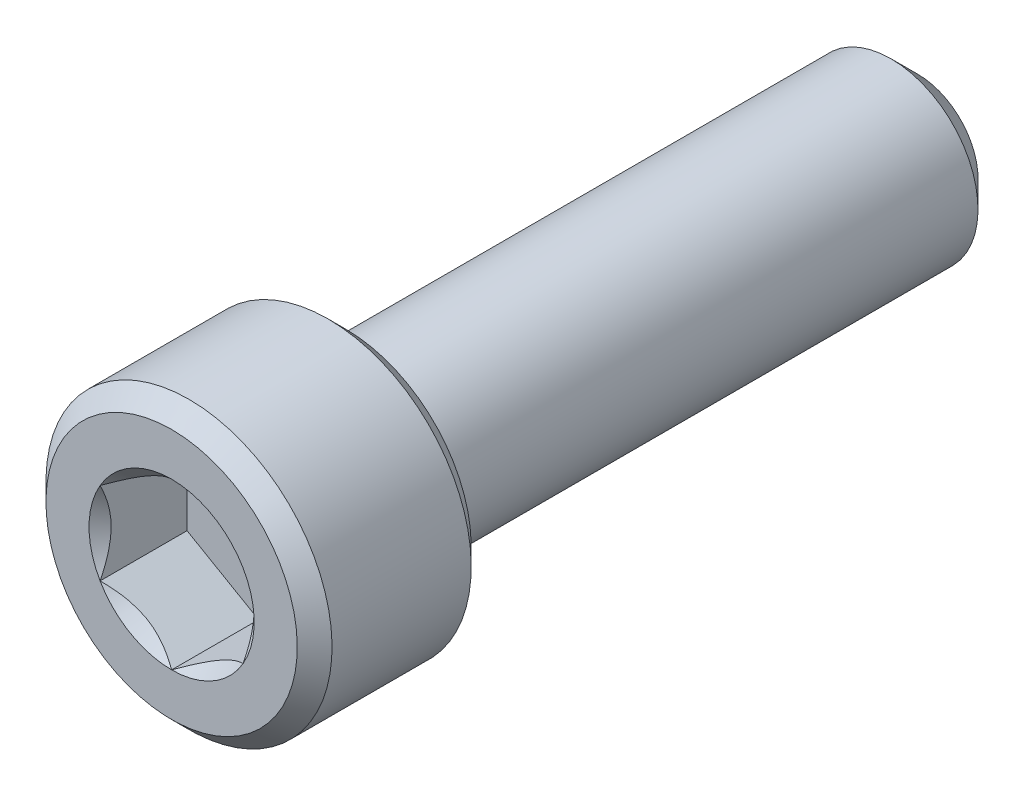
ISO-10303-21;
HEADER;
FILE_DESCRIPTION(('STEP AP214'),'2;1');
FILE_NAME('part.step','',(''),(''),'','','');
FILE_SCHEMA(('AUTOMOTIVE_DESIGN { 1 0 10303 214 1 1 1 1 }'));
ENDSEC;
DATA;
#1=APPLICATION_CONTEXT('core data for automotive mechanical design processes');
#2=APPLICATION_PROTOCOL_DEFINITION('international standard','automotive_design',2000,#1);
#3=PRODUCT_CONTEXT('',#1,'mechanical');
#4=PRODUCT('Part','Part','',(#3));
#5=PRODUCT_RELATED_PRODUCT_CATEGORY('part','',(#4));
#6=PRODUCT_DEFINITION_FORMATION('','',#4);
#7=PRODUCT_DEFINITION_CONTEXT('part definition',#1,'design');
#8=PRODUCT_DEFINITION('design','',#6,#7);
#9=PRODUCT_DEFINITION_SHAPE('','',#8);
#10=(LENGTH_UNIT() NAMED_UNIT(*) SI_UNIT(.MILLI.,.METRE.));
#11=(NAMED_UNIT(*) PLANE_ANGLE_UNIT() SI_UNIT($,.RADIAN.));
#12=(NAMED_UNIT(*) SI_UNIT($,.STERADIAN.) SOLID_ANGLE_UNIT());
#13=UNCERTAINTY_MEASURE_WITH_UNIT(LENGTH_MEASURE(1.E-05),#10,'distance_accuracy_value','');
#14=(GEOMETRIC_REPRESENTATION_CONTEXT(3) GLOBAL_UNCERTAINTY_ASSIGNED_CONTEXT((#13)) GLOBAL_UNIT_ASSIGNED_CONTEXT((#10,
#11,#12)) REPRESENTATION_CONTEXT('',''));
#15=CARTESIAN_POINT('',(0.,0.,0.));
#16=DIRECTION('',(0.,0.,1.));
#17=DIRECTION('',(1.,0.,0.));
#18=AXIS2_PLACEMENT_3D('',#15,#16,#17);
#19=CARTESIAN_POINT('',(0.,1.67216666666667,-10.3505));
#20=DIRECTION('',(0.,0.,-1.));
#21=DIRECTION('',(0.,1.,0.));
#22=AXIS2_PLACEMENT_3D('',#19,#20,#21);
#23=PLANE('',#22);
#24=CARTESIAN_POINT('',(0.,0.,-10.3505));
#25=DIRECTION('',(0.,0.,-1.));
#26=DIRECTION('',(0.,1.,0.));
#27=AXIS2_PLACEMENT_3D('',#24,#25,#26);
#28=CIRCLE('',#27,1.67216666666668);
#29=CARTESIAN_POINT('',(0.,1.67216666666667,-10.3505));
#30=VERTEX_POINT('',#29);
#31=EDGE_CURVE('E217',#30,#30,#28,.T.);
#32=ORIENTED_EDGE('',*,*,#31,.T.);
#33=EDGE_LOOP('',(#32));
#34=FACE_BOUND('',#33,.T.);
#35=ADVANCED_FACE('F38',(#34),#23,.T.);
#36=CARTESIAN_POINT('',(0.,0.,10.3505));
#37=DIRECTION('',(0.,0.,1.));
#38=DIRECTION('',(0.,-1.,0.));
#39=AXIS2_PLACEMENT_3D('',#36,#37,#38);
#40=PLANE('',#39);
#41=CARTESIAN_POINT('',(0.,0.,10.3505));
#42=DIRECTION('',(0.,0.,1.));
#43=DIRECTION('',(1.,0.,0.));
#44=AXIS2_PLACEMENT_3D('',#41,#42,#43);
#45=CIRCLE('',#44,2.29135888084633);
#46=CARTESIAN_POINT('',(0.,-2.29135888084633,10.3505));
#47=VERTEX_POINT('',#46);
#48=CARTESIAN_POINT('',(1.98437500000001,-1.14567944042315,10.3505));
#49=VERTEX_POINT('',#48);
#50=EDGE_CURVE('E109',#47,#49,#45,.T.);
#51=ORIENTED_EDGE('',*,*,#50,.F.);
#52=CARTESIAN_POINT('',(-1.984375,-1.14567944042316,10.3505));
#53=VERTEX_POINT('',#52);
#54=EDGE_CURVE('E98',#53,#47,#45,.T.);
#55=ORIENTED_EDGE('',*,*,#54,.F.);
#56=CARTESIAN_POINT('',(-1.984375,1.14567944042317,10.3505));
#57=VERTEX_POINT('',#56);
#58=EDGE_CURVE('E108',#57,#53,#45,.T.);
#59=ORIENTED_EDGE('',*,*,#58,.F.);
#60=CARTESIAN_POINT('',(0.,2.29135888084633,10.3505));
#61=VERTEX_POINT('',#60);
#62=EDGE_CURVE('E58',#61,#57,#45,.T.);
#63=ORIENTED_EDGE('',*,*,#62,.F.);
#64=CARTESIAN_POINT('',(1.984375,1.14567944042317,10.3505));
#65=VERTEX_POINT('',#64);
#66=EDGE_CURVE('E65',#65,#61,#45,.T.);
#67=ORIENTED_EDGE('',*,*,#66,.F.);
#68=EDGE_CURVE('E139',#49,#65,#45,.T.);
#69=ORIENTED_EDGE('',*,*,#68,.F.);
#70=EDGE_LOOP('',(#51,#55,#59,#63,#67,#69));
#71=FACE_BOUND('',#70,.T.);
#72=CARTESIAN_POINT('',(0.,0.,10.3505));
#73=DIRECTION('',(0.,0.,-1.));
#74=DIRECTION('',(0.,1.,0.));
#75=AXIS2_PLACEMENT_3D('',#72,#73,#74);
#76=CIRCLE('',#75,3.48615);
#77=CARTESIAN_POINT('',(0.,3.48614999999999,10.3505));
#78=VERTEX_POINT('',#77);
#79=EDGE_CURVE('E52',#78,#78,#76,.T.);
#80=ORIENTED_EDGE('',*,*,#79,.F.);
#81=EDGE_LOOP('',(#80));
#82=FACE_BOUND('',#81,.T.);
#83=ADVANCED_FACE('F137',(#71,#82),#40,.T.);
#84=CARTESIAN_POINT('',(0.,0.,9.86790000000001));
#85=DIRECTION('',(0.,0.,-1.));
#86=DIRECTION('',(0.,1.,0.));
#87=AXIS2_PLACEMENT_3D('',#84,#85,#86);
#88=CONICAL_SURFACE('',#87,3.96875,0.785398163397448);
#89=ORIENTED_EDGE('',*,*,#79,.T.);
#90=EDGE_LOOP('',(#89));
#91=FACE_BOUND('',#90,.T.);
#92=CARTESIAN_POINT('',(0.,0.,9.86790000000001));
#93=DIRECTION('',(0.,0.,-1.));
#94=DIRECTION('',(0.,1.,0.));
#95=AXIS2_PLACEMENT_3D('',#92,#93,#94);
#96=CIRCLE('',#95,3.96875);
#97=CARTESIAN_POINT('',(0.,3.96874999999999,9.86790000000001));
#98=VERTEX_POINT('',#97);
#99=EDGE_CURVE('E243',#98,#98,#96,.T.);
#100=ORIENTED_EDGE('',*,*,#99,.F.);
#101=EDGE_LOOP('',(#100));
#102=FACE_BOUND('',#101,.T.);
#103=ADVANCED_FACE('F214',(#91,#102),#88,.T.);
#104=CARTESIAN_POINT('',(0.,0.,-10.3505));
#105=DIRECTION('',(0.,0.,-1.));
#106=DIRECTION('',(0.,1.,0.));
#107=AXIS2_PLACEMENT_3D('',#104,#105,#106);
#108=CYLINDRICAL_SURFACE('',#107,3.96875);
#109=ORIENTED_EDGE('',*,*,#99,.T.);
#110=EDGE_LOOP('',(#109));
#111=FACE_BOUND('',#110,.T.);
#112=CARTESIAN_POINT('',(0.,0.,6.0071));
#113=DIRECTION('',(0.,0.,-1.));
#114=DIRECTION('',(0.,1.,0.));
#115=AXIS2_PLACEMENT_3D('',#112,#113,#114);
#116=CIRCLE('',#115,3.96875);
#117=CARTESIAN_POINT('',(0.,3.96874999999999,6.0071));
#118=VERTEX_POINT('',#117);
#119=EDGE_CURVE('E239',#118,#118,#116,.T.);
#120=ORIENTED_EDGE('',*,*,#119,.F.);
#121=EDGE_LOOP('',(#120));
#122=FACE_BOUND('',#121,.T.);
#123=ADVANCED_FACE('F253',(#111,#122),#108,.T.);
#124=CARTESIAN_POINT('',(0.,0.,5.5245));
#125=DIRECTION('',(0.,0.,1.));
#126=DIRECTION('',(0.,-1.,0.));
#127=AXIS2_PLACEMENT_3D('',#124,#125,#126);
#128=CONICAL_SURFACE('',#127,3.48614999999999,0.785398163397455);
#129=ORIENTED_EDGE('',*,*,#119,.T.);
#130=EDGE_LOOP('',(#129));
#131=FACE_BOUND('',#130,.T.);
#132=CARTESIAN_POINT('',(0.,0.,5.5245));
#133=DIRECTION('',(0.,0.,-1.));
#134=DIRECTION('',(0.,1.,0.));
#135=AXIS2_PLACEMENT_3D('',#132,#133,#134);
#136=CIRCLE('',#135,3.48614999999999);
#137=CARTESIAN_POINT('',(0.,3.48614999999998,5.5245));
#138=VERTEX_POINT('',#137);
#139=EDGE_CURVE('E235',#138,#138,#136,.T.);
#140=ORIENTED_EDGE('',*,*,#139,.F.);
#141=EDGE_LOOP('',(#140));
#142=FACE_BOUND('',#141,.T.);
#143=ADVANCED_FACE('F259',(#131,#142),#128,.T.);
#144=CARTESIAN_POINT('',(0.,3.48614999999998,5.5245));
#145=DIRECTION('',(0.,0.,-1.));
#146=DIRECTION('',(0.,1.,0.));
#147=AXIS2_PLACEMENT_3D('',#144,#145,#146);
#148=PLANE('',#147);
#149=ORIENTED_EDGE('',*,*,#139,.T.);
#150=EDGE_LOOP('',(#149));
#151=FACE_BOUND('',#150,.T.);
#152=CARTESIAN_POINT('',(0.,0.,5.5245));
#153=DIRECTION('',(0.,0.,-1.));
#154=DIRECTION('',(0.,1.,0.));
#155=AXIS2_PLACEMENT_3D('',#152,#153,#154);
#156=CIRCLE('',#155,2.41300000000001);
#157=CARTESIAN_POINT('',(0.,2.413,5.5245));
#158=VERTEX_POINT('',#157);
#159=EDGE_CURVE('E225',#158,#158,#156,.T.);
#160=ORIENTED_EDGE('',*,*,#159,.F.);
#161=EDGE_LOOP('',(#160));
#162=FACE_BOUND('',#161,.T.);
#163=ADVANCED_FACE('F265',(#151,#162),#148,.T.);
#164=CARTESIAN_POINT('',(0.,0.,-10.3505));
#165=DIRECTION('',(0.,0.,-1.));
#166=DIRECTION('',(0.,1.,0.));
#167=AXIS2_PLACEMENT_3D('',#164,#165,#166);
#168=CYLINDRICAL_SURFACE('',#167,2.41300000000001);
#169=ORIENTED_EDGE('',*,*,#159,.T.);
#170=EDGE_LOOP('',(#169));
#171=FACE_BOUND('',#170,.T.);
#172=CARTESIAN_POINT('',(0.,0.,-9.60966666666667));
#173=DIRECTION('',(0.,0.,-1.));
#174=DIRECTION('',(0.,1.,0.));
#175=AXIS2_PLACEMENT_3D('',#172,#173,#174);
#176=CIRCLE('',#175,2.41300000000001);
#177=CARTESIAN_POINT('',(0.,2.41300000000001,-9.60966666666667));
#178=VERTEX_POINT('',#177);
#179=EDGE_CURVE('E220',#178,#178,#176,.T.);
#180=ORIENTED_EDGE('',*,*,#179,.F.);
#181=EDGE_LOOP('',(#180));
#182=FACE_BOUND('',#181,.T.);
#183=ADVANCED_FACE('F271',(#171,#182),#168,.T.);
#184=CARTESIAN_POINT('',(0.,0.,-10.3505));
#185=DIRECTION('',(0.,0.,1.));
#186=DIRECTION('',(0.,-1.,0.));
#187=AXIS2_PLACEMENT_3D('',#184,#185,#186);
#188=CONICAL_SURFACE('',#187,1.67216666666668,0.785398163397454);
#189=ORIENTED_EDGE('',*,*,#179,.T.);
#190=EDGE_LOOP('',(#189));
#191=FACE_BOUND('',#190,.T.);
#192=ORIENTED_EDGE('',*,*,#31,.F.);
#193=EDGE_LOOP('',(#192));
#194=FACE_BOUND('',#193,.T.);
#195=ADVANCED_FACE('F277',(#191,#194),#188,.T.);
#196=CARTESIAN_POINT('',(0.,0.,10.3505));
#197=DIRECTION('',(0.,0.,1.));
#198=DIRECTION('',(1.,0.,0.));
#199=AXIS2_PLACEMENT_3D('',#196,#197,#198);
#200=CONICAL_SURFACE('',#199,2.29135888084633,0.78539816339745);
#201=ORIENTED_EDGE('',*,*,#50,.T.);
#202=CARTESIAN_POINT('',(-0.000199999999999756,-2.29147435090016,10.3506154787818));
#203=CARTESIAN_POINT('',(0.0680159951668026,-2.25208982772757,10.3112628522639));
#204=CARTESIAN_POINT('',(0.137372685106966,-2.21204672412051,10.2742213104462));
#205=CARTESIAN_POINT('',(0.278798800452187,-2.13039431835551,10.2063988584233));
#206=CARTESIAN_POINT('',(0.350881678736781,-2.08877724917393,10.1756556890917));
#207=CARTESIAN_POINT('',(0.496233397266002,-2.00485839535391,10.1229918888112));
#208=CARTESIAN_POINT('',(0.569465212486936,-1.96257798712286,10.10093887588));
#209=CARTESIAN_POINT('',(0.717541182594703,-1.87708628592063,10.0669614929439));
#210=CARTESIAN_POINT('',(0.792380812753421,-1.83387760530244,10.0550117560917));
#211=CARTESIAN_POINT('',(0.921360414543812,-1.75941119748879,10.0442300990819));
#212=CARTESIAN_POINT('',(0.975333715772438,-1.72824969749539,10.0426338990591));
#213=CARTESIAN_POINT('',(1.0831921185198,-1.66597761963484,10.0453218388653));
#214=CARTESIAN_POINT('',(1.13707718248552,-1.63486706344893,10.0496080403405));
#215=CARTESIAN_POINT('',(1.2443385382486,-1.57293969082547,10.0638168730135));
#216=CARTESIAN_POINT('',(1.29771419276014,-1.54212324232506,10.0737458104523));
#217=CARTESIAN_POINT('',(1.40354251740889,-1.48102323060121,10.0986950842745));
#218=CARTESIAN_POINT('',(1.4559952579711,-1.45073962671789,10.1137150303895));
#219=CARTESIAN_POINT('',(1.59035733896364,-1.37316564308797,10.1583078516357));
#220=CARTESIAN_POINT('',(1.67143335715832,-1.32635638215845,10.1912429959383));
#221=CARTESIAN_POINT('',(1.79064830672984,-1.2575275989319,10.2468424412022));
#222=CARTESIAN_POINT('',(1.829934924386,-1.23484545965257,10.2663775920519));
#223=CARTESIAN_POINT('',(1.90778036186805,-1.18990137536712,10.3072287381194));
#224=CARTESIAN_POINT('',(1.9463396111017,-1.16763918244233,10.3285436395683));
#225=CARTESIAN_POINT('',(1.984575,-1.14556397036932,10.3506154787818));
#226=B_SPLINE_CURVE_WITH_KNOTS('',3,(#202,#203,#204,#205,#206,#207,#208,#209,#210,#211,#212,
#213,#214,#215,#216,#217,#218,#219,#220,#221,#222,#223,#224,#225),.UNSPECIFIED.,.F.,.F.,(4,2,2,
2,2,2,2,2,2,2,2,4),(0.,0.264339630306625,0.530219665093692,0.791876416371456,1.05287424418109,
1.239639843932,1.42647091743852,1.61351120244034,1.8005371524754,2.09764209964316,
2.24579179873713,2.39385111134157),.UNSPECIFIED.);
#227=EDGE_CURVE('E11',#47,#49,#226,.T.);
#228=ORIENTED_EDGE('',*,*,#227,.F.);
#229=EDGE_LOOP('',(#201,#228));
#230=FACE_BOUND('',#229,.T.);
#231=ADVANCED_FACE('F113',(#230),#200,.F.);
#232=ORIENTED_EDGE('',*,*,#68,.T.);
#233=CARTESIAN_POINT('',(1.984375,-2.28495242157822,11.0854840788166));
#234=CARTESIAN_POINT('',(1.984375,-2.22931635455401,11.0434866855508));
#235=CARTESIAN_POINT('',(1.984375,-2.17336876548388,11.0018960540763));
#236=CARTESIAN_POINT('',(1.984375,-2.0607277025817,10.9197084614715));
#237=CARTESIAN_POINT('',(1.984375,-2.00403404503434,10.879111752405));
#238=CARTESIAN_POINT('',(1.984375,-1.88936329173488,10.7988035031747));
#239=CARTESIAN_POINT('',(1.984375,-1.83137965519348,10.7591012588133));
#240=CARTESIAN_POINT('',(1.984375,-1.7144280213784,10.6811851734013));
#241=CARTESIAN_POINT('',(1.984375,-1.65546009407227,10.6429712271944));
#242=CARTESIAN_POINT('',(1.984375,-1.47005472306035,10.5267528340136));
#243=CARTESIAN_POINT('',(1.984375,-1.34163909427883,10.4518478868724));
#244=CARTESIAN_POINT('',(1.984375,-1.0784038470548,10.3148302154397));
#245=CARTESIAN_POINT('',(1.984375,-0.943607781407422,10.2526743664824));
#246=CARTESIAN_POINT('',(1.984375,-0.74127510044488,10.1766325786886));
#247=CARTESIAN_POINT('',(1.984375,-0.676735408881094,10.154808061326));
#248=CARTESIAN_POINT('',(1.984375,-0.54609811811276,10.1163404635378));
#249=CARTESIAN_POINT('',(1.984375,-0.480000411919954,10.0996977400655));
#250=CARTESIAN_POINT('',(1.984375,-0.34774617002853,10.0727353808697));
#251=CARTESIAN_POINT('',(1.984375,-0.281612071479121,10.0623074097359));
#252=CARTESIAN_POINT('',(1.984375,-0.148636620052348,10.0479781473766));
#253=CARTESIAN_POINT('',(1.984375,-0.0817953907393219,10.0440757342274));
#254=CARTESIAN_POINT('',(1.984375,0.0495156750890661,10.0430870513327));
#255=CARTESIAN_POINT('',(1.984375,0.113983775102993,10.045759178875));
#256=CARTESIAN_POINT('',(1.984375,0.242367515846178,10.0572392104975));
#257=CARTESIAN_POINT('',(1.984375,0.306283102295921,10.0660477106392));
#258=CARTESIAN_POINT('',(1.984375,0.434181040262185,10.0894690213329));
#259=CARTESIAN_POINT('',(1.984375,0.49814502685831,10.1041806062321));
#260=CARTESIAN_POINT('',(1.984375,0.624675616953008,10.1386261814121));
#261=CARTESIAN_POINT('',(1.984375,0.687242336899689,10.1583597514492));
#262=CARTESIAN_POINT('',(1.984375,0.884225483826088,10.2279122372308));
#263=CARTESIAN_POINT('',(1.984375,1.01583674256468,10.2856524112565));
#264=CARTESIAN_POINT('',(1.984375,1.27288659242652,10.4140303365888));
#265=CARTESIAN_POINT('',(1.984375,1.3983008827048,10.4847144249194));
#266=CARTESIAN_POINT('',(1.984375,1.57956687990221,10.5950166638132));
#267=CARTESIAN_POINT('',(1.984375,1.63738271299424,10.6314698294754));
#268=CARTESIAN_POINT('',(1.984375,1.75202215386202,10.7059159632917));
#269=CARTESIAN_POINT('',(1.984375,1.80884568601362,10.7439090480781));
#270=CARTESIAN_POINT('',(1.984375,1.92116923084256,10.8208388088931));
#271=CARTESIAN_POINT('',(1.984375,1.97667624512254,10.8597653130388));
#272=CARTESIAN_POINT('',(1.984375,2.08693170717167,10.9386477461214));
#273=CARTESIAN_POINT('',(1.984375,2.14168035934793,10.978603389024));
#274=CARTESIAN_POINT('',(1.984375,2.19611149046623,11.0189806112854));
#275=B_SPLINE_CURVE_WITH_KNOTS('',3,(#233,#234,#235,#236,#237,#238,#239,#240,#241,#242,#243,
#244,#245,#246,#247,#248,#249,#250,#251,#252,#253,#254,#255,#256,#257,#258,#259,#260,#261,#262,
#263,#264,#265,#266,#267,#268,#269,#270,#271,#272,#273,#274),.UNSPECIFIED.,.F.,.F.,(4,2,2,2,2,2,
2,2,2,2,2,2,2,2,2,2,2,2,2,2,4),(0.,0.209126070008323,0.418304637356568,0.629103979977989,
0.839888401371182,1.28549951116126,1.72957750768351,1.93379389749971,2.13802435186697,
2.33858179514333,2.53910475350638,2.73236963400794,2.92565329006886,3.12231577097487,
3.31896180041344,3.74886295245171,4.18033428125362,4.3853601718029,4.59040161996382,
4.79377749165107,4.99709743524131),.UNSPECIFIED.);
#276=EDGE_CURVE('E145',#49,#65,#275,.T.);
#277=ORIENTED_EDGE('',*,*,#276,.F.);
#278=EDGE_LOOP('',(#232,#277));
#279=FACE_BOUND('',#278,.T.);
#280=ADVANCED_FACE('F286',(#279),#200,.F.);
#281=ORIENTED_EDGE('',*,*,#66,.T.);
#282=CARTESIAN_POINT('',(1.984575,1.14556397036933,10.3506154787818));
#283=CARTESIAN_POINT('',(1.9163590048332,1.18494849354193,10.3112628522639));
#284=CARTESIAN_POINT('',(1.84700231489303,1.22499159714898,10.2742213104462));
#285=CARTESIAN_POINT('',(1.70557619954781,1.30664400291399,10.2063988584233));
#286=CARTESIAN_POINT('',(1.63349332126322,1.34826107209556,10.1756556890918));
#287=CARTESIAN_POINT('',(1.488141602734,1.43217992591558,10.1229918888112));
#288=CARTESIAN_POINT('',(1.41490978751306,1.47446033414663,10.10093887588));
#289=CARTESIAN_POINT('',(1.26683381740529,1.55995203534887,10.0669614929439));
#290=CARTESIAN_POINT('',(1.19199418724658,1.60316071596706,10.0550117560917));
#291=CARTESIAN_POINT('',(1.06301458545619,1.67762712378071,10.0442300990819));
#292=CARTESIAN_POINT('',(1.00904128422756,1.70878862377411,10.0426338990591));
#293=CARTESIAN_POINT('',(0.9011828814802,1.77106070163466,10.0453218388653));
#294=CARTESIAN_POINT('',(0.847297817514477,1.80217125782057,10.0496080403405));
#295=CARTESIAN_POINT('',(0.740036461751395,1.86409863044403,10.0638168730135));
#296=CARTESIAN_POINT('',(0.686660807239859,1.89491507894444,10.0737458104523));
#297=CARTESIAN_POINT('',(0.580832482591102,1.95601509066828,10.0986950842745));
#298=CARTESIAN_POINT('',(0.528379742028897,1.98629869455161,10.1137150303895));
#299=CARTESIAN_POINT('',(0.39401766103635,2.06387267818153,10.1583078516357));
#300=CARTESIAN_POINT('',(0.312941642841675,2.11068193911105,10.1912429959383));
#301=CARTESIAN_POINT('',(0.193726693270161,2.17951072233759,10.2468424412022));
#302=CARTESIAN_POINT('',(0.154440075614,2.20219286161693,10.2663775920519));
#303=CARTESIAN_POINT('',(0.0765946381319486,2.24713694590237,10.3072287381194));
#304=CARTESIAN_POINT('',(0.038035388898303,2.26939913882717,10.3285436395684));
#305=CARTESIAN_POINT('',(-0.000199999999998248,2.29147435090017,10.3506154787819));
#306=B_SPLINE_CURVE_WITH_KNOTS('',3,(#282,#283,#284,#285,#286,#287,#288,#289,#290,#291,#292,
#293,#294,#295,#296,#297,#298,#299,#300,#301,#302,#303,#304,#305),.UNSPECIFIED.,.F.,.F.,(4,2,2,
2,2,2,2,2,2,2,2,4),(0.,0.264339630306625,0.530219665093693,0.791876416371458,1.05287424418109,
1.239639843932,1.42647091743852,1.61351120244035,1.8005371524754,2.09764209964316,
2.24579179873713,2.39385111134157),.UNSPECIFIED.);
#307=EDGE_CURVE('E154',#65,#61,#306,.T.);
#308=ORIENTED_EDGE('',*,*,#307,.F.);
#309=EDGE_LOOP('',(#281,#308));
#310=FACE_BOUND('',#309,.T.);
#311=ADVANCED_FACE('F353',(#310),#200,.F.);
#312=ORIENTED_EDGE('',*,*,#62,.T.);
#313=CARTESIAN_POINT('',(0.000200000000001233,2.29147435090017,10.3506154787819));
#314=CARTESIAN_POINT('',(-0.068015995166801,2.25208982772758,10.3112628522639));
#315=CARTESIAN_POINT('',(-0.137372685106965,2.21204672412053,10.2742213104462));
#316=CARTESIAN_POINT('',(-0.278798800452187,2.13039431835552,10.2063988584233));
#317=CARTESIAN_POINT('',(-0.350881678736783,2.08877724917394,10.1756556890918));
#318=CARTESIAN_POINT('',(-0.496233397266005,2.00485839535392,10.1229918888112));
#319=CARTESIAN_POINT('',(-0.569465212486939,1.96257798712287,10.10093887588));
#320=CARTESIAN_POINT('',(-0.717541182594708,1.87708628592064,10.0669614929439));
#321=CARTESIAN_POINT('',(-0.792380812753426,1.83387760530245,10.0550117560917));
#322=CARTESIAN_POINT('',(-0.921360414543818,1.75941119748879,10.0442300990819));
#323=CARTESIAN_POINT('',(-0.975333715772444,1.72824969749539,10.0426338990591));
#324=CARTESIAN_POINT('',(-1.0831921185198,1.66597761963484,10.0453218388653));
#325=CARTESIAN_POINT('',(-1.13707718248553,1.63486706344893,10.0496080403405));
#326=CARTESIAN_POINT('',(-1.24433853824861,1.57293969082547,10.0638168730135));
#327=CARTESIAN_POINT('',(-1.29771419276014,1.54212324232507,10.0737458104523));
#328=CARTESIAN_POINT('',(-1.4035425174089,1.48102323060122,10.0986950842745));
#329=CARTESIAN_POINT('',(-1.45599525797111,1.4507396267179,10.1137150303895));
#330=CARTESIAN_POINT('',(-1.59035733896365,1.37316564308797,10.1583078516357));
#331=CARTESIAN_POINT('',(-1.67143335715833,1.32635638215845,10.1912429959383));
#332=CARTESIAN_POINT('',(-1.79064830672984,1.25752759893191,10.2468424412022));
#333=CARTESIAN_POINT('',(-1.829934924386,1.23484545965258,10.2663775920519));
#334=CARTESIAN_POINT('',(-1.90778036186805,1.18990137536713,10.3072287381194));
#335=CARTESIAN_POINT('',(-1.9463396111017,1.16763918244234,10.3285436395684));
#336=CARTESIAN_POINT('',(-1.984575,1.14556397036933,10.3506154787818));
#337=B_SPLINE_CURVE_WITH_KNOTS('',3,(#313,#314,#315,#316,#317,#318,#319,#320,#321,#322,#323,
#324,#325,#326,#327,#328,#329,#330,#331,#332,#333,#334,#335,#336),.UNSPECIFIED.,.F.,.F.,(4,2,2,
2,2,2,2,2,2,2,2,4),(0.,0.264339630306627,0.530219665093696,0.791876416371464,1.0528742441811,
1.23963984393201,1.42647091743853,1.61351120244035,1.80053715247541,2.09764209964317,
2.24579179873714,2.39385111134157),.UNSPECIFIED.);
#338=EDGE_CURVE('E174',#61,#57,#337,.T.);
#339=ORIENTED_EDGE('',*,*,#338,.F.);
#340=EDGE_LOOP('',(#312,#339));
#341=FACE_BOUND('',#340,.T.);
#342=ADVANCED_FACE('F349',(#341),#200,.F.);
#343=ORIENTED_EDGE('',*,*,#58,.T.);
#344=CARTESIAN_POINT('',(-1.984375,-2.28495242157822,11.0854840788166));
#345=CARTESIAN_POINT('',(-1.984375,-2.22931635455401,11.0434866855508));
#346=CARTESIAN_POINT('',(-1.984375,-2.17336876548389,11.0018960540763));
#347=CARTESIAN_POINT('',(-1.984375,-2.0607277025817,10.9197084614715));
#348=CARTESIAN_POINT('',(-1.984375,-2.00403404503434,10.879111752405));
#349=CARTESIAN_POINT('',(-1.984375,-1.88936329173488,10.7988035031747));
#350=CARTESIAN_POINT('',(-1.984375,-1.83137965519348,10.7591012588133));
#351=CARTESIAN_POINT('',(-1.984375,-1.7144280213784,10.6811851734013));
#352=CARTESIAN_POINT('',(-1.984375,-1.65546009407227,10.6429712271944));
#353=CARTESIAN_POINT('',(-1.984375,-1.47005472306035,10.5267528340136));
#354=CARTESIAN_POINT('',(-1.984375,-1.34163909427883,10.4518478868724));
#355=CARTESIAN_POINT('',(-1.984375,-1.0784038470548,10.3148302154397));
#356=CARTESIAN_POINT('',(-1.984375,-0.943607781407424,10.2526743664824));
#357=CARTESIAN_POINT('',(-1.984375,-0.741275100444882,10.1766325786886));
#358=CARTESIAN_POINT('',(-1.984375,-0.676735408881095,10.154808061326));
#359=CARTESIAN_POINT('',(-1.984375,-0.546098118112762,10.1163404635378));
#360=CARTESIAN_POINT('',(-1.984375,-0.480000411919956,10.0996977400655));
#361=CARTESIAN_POINT('',(-1.984375,-0.347746170028532,10.0727353808697));
#362=CARTESIAN_POINT('',(-1.984375,-0.281612071479123,10.0623074097359));
#363=CARTESIAN_POINT('',(-1.984375,-0.14863662005235,10.0479781473766));
#364=CARTESIAN_POINT('',(-1.984375,-0.0817953907393238,10.0440757342274));
#365=CARTESIAN_POINT('',(-1.984375,0.049515675089064,10.0430870513327));
#366=CARTESIAN_POINT('',(-1.984375,0.113983775102991,10.045759178875));
#367=CARTESIAN_POINT('',(-1.984375,0.242367515846176,10.0572392104975));
#368=CARTESIAN_POINT('',(-1.984375,0.306283102295918,10.0660477106392));
#369=CARTESIAN_POINT('',(-1.984375,0.434181040262182,10.0894690213329));
#370=CARTESIAN_POINT('',(-1.984375,0.498145026858308,10.1041806062321));
#371=CARTESIAN_POINT('',(-1.984375,0.624675616953005,10.1386261814121));
#372=CARTESIAN_POINT('',(-1.984375,0.687242336899687,10.1583597514492));
#373=CARTESIAN_POINT('',(-1.984375,0.884225483826086,10.2279122372308));
#374=CARTESIAN_POINT('',(-1.984375,1.01583674256468,10.2856524112565));
#375=CARTESIAN_POINT('',(-1.984375,1.27288659242652,10.4140303365888));
#376=CARTESIAN_POINT('',(-1.984375,1.3983008827048,10.4847144249194));
#377=CARTESIAN_POINT('',(-1.984375,1.57956687990221,10.5950166638132));
#378=CARTESIAN_POINT('',(-1.984375,1.63738271299424,10.6314698294754));
#379=CARTESIAN_POINT('',(-1.984375,1.75202215386202,10.7059159632917));
#380=CARTESIAN_POINT('',(-1.984375,1.80884568601362,10.7439090480781));
#381=CARTESIAN_POINT('',(-1.984375,1.92116923084255,10.8208388088931));
#382=CARTESIAN_POINT('',(-1.984375,1.97667624512253,10.8597653130388));
#383=CARTESIAN_POINT('',(-1.984375,2.08693170717166,10.9386477461214));
#384=CARTESIAN_POINT('',(-1.984375,2.14168035934793,10.978603389024));
#385=CARTESIAN_POINT('',(-1.984375,2.19611149046622,11.0189806112854));
#386=B_SPLINE_CURVE_WITH_KNOTS('',3,(#344,#345,#346,#347,#348,#349,#350,#351,#352,#353,#354,
#355,#356,#357,#358,#359,#360,#361,#362,#363,#364,#365,#366,#367,#368,#369,#370,#371,#372,#373,
#374,#375,#376,#377,#378,#379,#380,#381,#382,#383,#384,#385),.UNSPECIFIED.,.F.,.F.,(4,2,2,2,2,2,
2,2,2,2,2,2,2,2,2,2,2,2,2,2,4),(0.,0.209126070008321,0.418304637356568,0.62910397997799,
0.839888401371182,1.28549951116126,1.7295775076835,1.93379389749971,2.13802435186697,
2.33858179514333,2.53910475350638,2.73236963400793,2.92565329006886,3.12231577097486,
3.31896180041344,3.74886295245171,4.18033428125362,4.38536017180289,4.59040161996382,
4.79377749165107,4.9970974352413),.UNSPECIFIED.);
#387=EDGE_CURVE('E126',#57,#53,#386,.F.);
#388=ORIENTED_EDGE('',*,*,#387,.F.);
#389=EDGE_LOOP('',(#343,#388));
#390=FACE_BOUND('',#389,.T.);
#391=ADVANCED_FACE('F167',(#390),#200,.F.);
#392=ORIENTED_EDGE('',*,*,#54,.T.);
#393=CARTESIAN_POINT('',(-1.984575,-1.14556397036932,10.3506154787818));
#394=CARTESIAN_POINT('',(-1.9163590048332,-1.18494849354191,10.3112628522639));
#395=CARTESIAN_POINT('',(-1.84700231489303,-1.22499159714897,10.2742213104462));
#396=CARTESIAN_POINT('',(-1.70557619954781,-1.30664400291398,10.2063988584233));
#397=CARTESIAN_POINT('',(-1.63349332126322,-1.34826107209555,10.1756556890918));
#398=CARTESIAN_POINT('',(-1.48814160273399,-1.43217992591557,10.1229918888112));
#399=CARTESIAN_POINT('',(-1.41490978751306,-1.47446033414662,10.10093887588));
#400=CARTESIAN_POINT('',(-1.26683381740529,-1.55995203534886,10.0669614929439));
#401=CARTESIAN_POINT('',(-1.19199418724657,-1.60316071596704,10.0550117560917));
#402=CARTESIAN_POINT('',(-1.06301458545618,-1.6776271237807,10.0442300990819));
#403=CARTESIAN_POINT('',(-1.00904128422756,-1.7087886237741,10.0426338990591));
#404=CARTESIAN_POINT('',(-0.901182881480199,-1.77106070163465,10.0453218388653));
#405=CARTESIAN_POINT('',(-0.847297817514476,-1.80217125782056,10.0496080403405));
#406=CARTESIAN_POINT('',(-0.740036461751395,-1.86409863044402,10.0638168730135));
#407=CARTESIAN_POINT('',(-0.686660807239859,-1.89491507894442,10.0737458104523));
#408=CARTESIAN_POINT('',(-0.580832482591103,-1.95601509066827,10.0986950842745));
#409=CARTESIAN_POINT('',(-0.528379742028898,-1.98629869455159,10.1137150303895));
#410=CARTESIAN_POINT('',(-0.394017661036351,-2.06387267818152,10.1583078516357));
#411=CARTESIAN_POINT('',(-0.312941642841676,-2.11068193911104,10.1912429959383));
#412=CARTESIAN_POINT('',(-0.193726693270161,-2.17951072233758,10.2468424412022));
#413=CARTESIAN_POINT('',(-0.154440075613999,-2.20219286161691,10.2663775920519));
#414=CARTESIAN_POINT('',(-0.0765946381319472,-2.24713694590236,10.3072287381194));
#415=CARTESIAN_POINT('',(-0.0380353888983015,-2.26939913882716,10.3285436395683));
#416=CARTESIAN_POINT('',(0.000199999999999597,-2.29147435090016,10.3506154787818));
#417=B_SPLINE_CURVE_WITH_KNOTS('',3,(#393,#394,#395,#396,#397,#398,#399,#400,#401,#402,#403,
#404,#405,#406,#407,#408,#409,#410,#411,#412,#413,#414,#415,#416),.UNSPECIFIED.,.F.,.F.,(4,2,2,
2,2,2,2,2,2,2,2,4),(0.,0.264339630306626,0.530219665093694,0.79187641637146,1.05287424418109,
1.239639843932,1.42647091743852,1.61351120244034,1.8005371524754,2.09764209964316,
2.24579179873713,2.39385111134157),.UNSPECIFIED.);
#418=EDGE_CURVE('E102',#53,#47,#417,.T.);
#419=ORIENTED_EDGE('',*,*,#418,.F.);
#420=EDGE_LOOP('',(#392,#419));
#421=FACE_BOUND('',#420,.T.);
#422=ADVANCED_FACE('F100',(#421),#200,.F.);
#423=CARTESIAN_POINT('',(0.,0.,7.93750000000001));
#424=DIRECTION('',(0.,0.,1.));
#425=DIRECTION('',(1.,0.,0.));
#426=AXIS2_PLACEMENT_3D('',#423,#424,#425);
#427=PLANE('',#426);
#428=DIRECTION('',(0.866025403784439,-0.5,0.));
#429=VECTOR('',#428,1.);
#430=CARTESIAN_POINT('',(-1.984375,-1.14567944042316,7.93750000000001));
#431=LINE('',#430,#429);
#432=CARTESIAN_POINT('',(-1.984375,-1.14567944042316,7.93750000000001));
#433=VERTEX_POINT('',#432);
#434=CARTESIAN_POINT('',(0.,-2.29135888084632,7.93750000000001));
#435=VERTEX_POINT('',#434);
#436=EDGE_CURVE('E125',#433,#435,#431,.T.);
#437=ORIENTED_EDGE('',*,*,#436,.T.);
#438=DIRECTION('',(0.866025403784439,0.5,0.));
#439=VECTOR('',#438,1.);
#440=CARTESIAN_POINT('',(0.,-2.29135888084632,7.93750000000001));
#441=LINE('',#440,#439);
#442=CARTESIAN_POINT('',(1.984375,-1.14567944042316,7.93750000000001));
#443=VERTEX_POINT('',#442);
#444=EDGE_CURVE('E130',#435,#443,#441,.T.);
#445=ORIENTED_EDGE('',*,*,#444,.T.);
#446=DIRECTION('',(0.,1.,0.));
#447=VECTOR('',#446,1.);
#448=CARTESIAN_POINT('',(1.984375,-1.14567944042316,7.93750000000001));
#449=LINE('',#448,#447);
#450=CARTESIAN_POINT('',(1.984375,1.14567944042317,7.93750000000001));
#451=VERTEX_POINT('',#450);
#452=EDGE_CURVE('E304',#443,#451,#449,.T.);
#453=ORIENTED_EDGE('',*,*,#452,.T.);
#454=DIRECTION('',(-0.866025403784439,0.5,0.));
#455=VECTOR('',#454,1.);
#456=CARTESIAN_POINT('',(1.984375,1.14567944042317,7.93750000000001));
#457=LINE('',#456,#455);
#458=CARTESIAN_POINT('',(0.,2.29135888084633,7.93750000000001));
#459=VERTEX_POINT('',#458);
#460=EDGE_CURVE('E309',#451,#459,#457,.T.);
#461=ORIENTED_EDGE('',*,*,#460,.T.);
#462=DIRECTION('',(-0.866025403784438,-0.5,0.));
#463=VECTOR('',#462,1.);
#464=CARTESIAN_POINT('',(0.,2.29135888084633,7.93750000000001));
#465=LINE('',#464,#463);
#466=CARTESIAN_POINT('',(-1.984375,1.14567944042317,7.93750000000001));
#467=VERTEX_POINT('',#466);
#468=EDGE_CURVE('E313',#459,#467,#465,.T.);
#469=ORIENTED_EDGE('',*,*,#468,.T.);
#470=DIRECTION('',(0.,-1.,0.));
#471=VECTOR('',#470,1.);
#472=CARTESIAN_POINT('',(-1.984375,1.14567944042317,7.93750000000001));
#473=LINE('',#472,#471);
#474=EDGE_CURVE('E134',#467,#433,#473,.T.);
#475=ORIENTED_EDGE('',*,*,#474,.T.);
#476=EDGE_LOOP('',(#437,#445,#453,#461,#469,#475));
#477=FACE_BOUND('',#476,.T.);
#478=ADVANCED_FACE('F166',(#477),#427,.T.);
#479=CARTESIAN_POINT('',(0.,-2.29135888084632,7.93750000000001));
#480=DIRECTION('',(0.5,-0.866025403784439,0.));
#481=DIRECTION('',(0.866025403784439,0.5,0.));
#482=AXIS2_PLACEMENT_3D('',#479,#480,#481);
#483=PLANE('',#482);
#484=DIRECTION('',(0.,0.,1.));
#485=VECTOR('',#484,1.);
#486=CARTESIAN_POINT('',(0.,-2.29135888084632,7.93750000000001));
#487=LINE('',#486,#485);
#488=EDGE_CURVE('E120',#435,#47,#487,.T.);
#489=ORIENTED_EDGE('',*,*,#488,.T.);
#490=ORIENTED_EDGE('',*,*,#227,.T.);
#491=DIRECTION('',(0.,0.,1.));
#492=VECTOR('',#491,1.);
#493=CARTESIAN_POINT('',(1.984375,-1.14567944042316,7.93750000000001));
#494=LINE('',#493,#492);
#495=EDGE_CURVE('E133',#443,#49,#494,.T.);
#496=ORIENTED_EDGE('',*,*,#495,.F.);
#497=ORIENTED_EDGE('',*,*,#444,.F.);
#498=EDGE_LOOP('',(#489,#490,#496,#497));
#499=FACE_BOUND('',#498,.T.);
#500=ADVANCED_FACE('F128',(#499),#483,.F.);
#501=CARTESIAN_POINT('',(1.984375,-1.14567944042316,7.93750000000001));
#502=DIRECTION('',(1.,0.,0.));
#503=DIRECTION('',(0.,0.,-1.));
#504=AXIS2_PLACEMENT_3D('',#501,#502,#503);
#505=PLANE('',#504);
#506=ORIENTED_EDGE('',*,*,#495,.T.);
#507=ORIENTED_EDGE('',*,*,#276,.T.);
#508=DIRECTION('',(0.,0.,1.));
#509=VECTOR('',#508,1.);
#510=CARTESIAN_POINT('',(1.984375,1.14567944042317,7.93750000000001));
#511=LINE('',#510,#509);
#512=EDGE_CURVE('E325',#451,#65,#511,.T.);
#513=ORIENTED_EDGE('',*,*,#512,.F.);
#514=ORIENTED_EDGE('',*,*,#452,.F.);
#515=EDGE_LOOP('',(#506,#507,#513,#514));
#516=FACE_BOUND('',#515,.T.);
#517=ADVANCED_FACE('F161',(#516),#505,.F.);
#518=CARTESIAN_POINT('',(1.984375,1.14567944042317,7.93750000000001));
#519=DIRECTION('',(0.5,0.866025403784439,0.));
#520=DIRECTION('',(-0.866025403784439,0.5,0.));
#521=AXIS2_PLACEMENT_3D('',#518,#519,#520);
#522=PLANE('',#521);
#523=ORIENTED_EDGE('',*,*,#512,.T.);
#524=ORIENTED_EDGE('',*,*,#307,.T.);
#525=DIRECTION('',(0.,0.,1.));
#526=VECTOR('',#525,1.);
#527=CARTESIAN_POINT('',(0.,2.29135888084633,7.93750000000001));
#528=LINE('',#527,#526);
#529=EDGE_CURVE('E321',#459,#61,#528,.T.);
#530=ORIENTED_EDGE('',*,*,#529,.F.);
#531=ORIENTED_EDGE('',*,*,#460,.F.);
#532=EDGE_LOOP('',(#523,#524,#530,#531));
#533=FACE_BOUND('',#532,.T.);
#534=ADVANCED_FACE('F199',(#533),#522,.F.);
#535=CARTESIAN_POINT('',(0.,2.29135888084633,7.93750000000001));
#536=DIRECTION('',(-0.5,0.866025403784438,0.));
#537=DIRECTION('',(-0.866025403784438,-0.5,0.));
#538=AXIS2_PLACEMENT_3D('',#535,#536,#537);
#539=PLANE('',#538);
#540=ORIENTED_EDGE('',*,*,#529,.T.);
#541=ORIENTED_EDGE('',*,*,#338,.T.);
#542=DIRECTION('',(0.,0.,1.));
#543=VECTOR('',#542,1.);
#544=CARTESIAN_POINT('',(-1.984375,1.14567944042317,7.93750000000001));
#545=LINE('',#544,#543);
#546=EDGE_CURVE('E228',#467,#57,#545,.T.);
#547=ORIENTED_EDGE('',*,*,#546,.F.);
#548=ORIENTED_EDGE('',*,*,#468,.F.);
#549=EDGE_LOOP('',(#540,#541,#547,#548));
#550=FACE_BOUND('',#549,.T.);
#551=ADVANCED_FACE('F195',(#550),#539,.F.);
#552=CARTESIAN_POINT('',(-1.984375,1.14567944042317,7.93750000000001));
#553=DIRECTION('',(-1.,0.,0.));
#554=DIRECTION('',(0.,-1.,0.));
#555=AXIS2_PLACEMENT_3D('',#552,#553,#554);
#556=PLANE('',#555);
#557=ORIENTED_EDGE('',*,*,#546,.T.);
#558=ORIENTED_EDGE('',*,*,#387,.T.);
#559=DIRECTION('',(0.,0.,1.));
#560=VECTOR('',#559,1.);
#561=CARTESIAN_POINT('',(-1.984375,-1.14567944042316,7.93750000000001));
#562=LINE('',#561,#560);
#563=EDGE_CURVE('E122',#433,#53,#562,.T.);
#564=ORIENTED_EDGE('',*,*,#563,.F.);
#565=ORIENTED_EDGE('',*,*,#474,.F.);
#566=EDGE_LOOP('',(#557,#558,#564,#565));
#567=FACE_BOUND('',#566,.T.);
#568=ADVANCED_FACE('F192',(#567),#556,.F.);
#569=CARTESIAN_POINT('',(-1.984375,-1.14567944042316,7.93750000000001));
#570=DIRECTION('',(-0.5,-0.866025403784439,0.));
#571=DIRECTION('',(0.866025403784439,-0.5,0.));
#572=AXIS2_PLACEMENT_3D('',#569,#570,#571);
#573=PLANE('',#572);
#574=ORIENTED_EDGE('',*,*,#563,.T.);
#575=ORIENTED_EDGE('',*,*,#418,.T.);
#576=ORIENTED_EDGE('',*,*,#488,.F.);
#577=ORIENTED_EDGE('',*,*,#436,.F.);
#578=EDGE_LOOP('',(#574,#575,#576,#577));
#579=FACE_BOUND('',#578,.T.);
#580=ADVANCED_FACE('F118',(#579),#573,.F.);
#581=CLOSED_SHELL('',(#35,#83,#103,#123,#143,#163,#183,#195,#231,#280,#311,#342,#391,#422,#478,
#500,#517,#534,#551,#568,#580));
#582=MANIFOLD_SOLID_BREP('B2',#581);
#583=ADVANCED_BREP_SHAPE_REPRESENTATION('',(#18,#582),#14);
#584=SHAPE_DEFINITION_REPRESENTATION(#9,#583);
ENDSEC;
END-ISO-10303-21;
